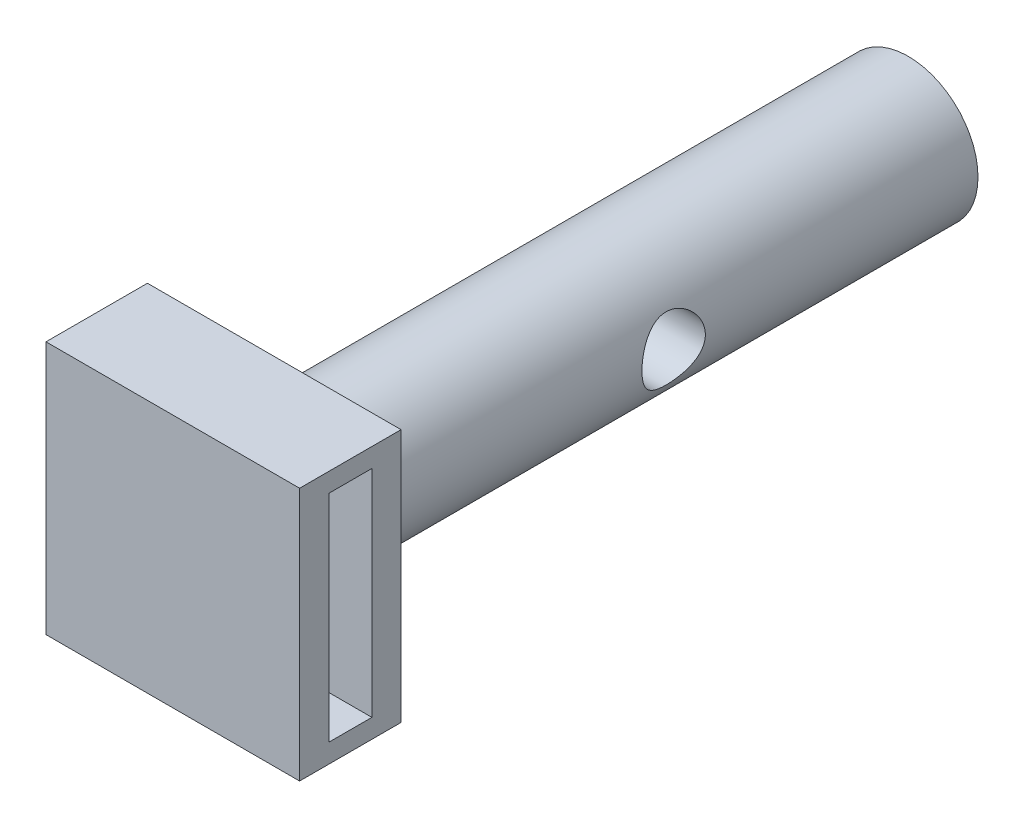
ISO-10303-21;
HEADER;
FILE_DESCRIPTION(('STEP AP214'),'2;1');
FILE_NAME('part.step','',(''),(''),'','','');
FILE_SCHEMA(('AUTOMOTIVE_DESIGN { 1 0 10303 214 1 1 1 1 }'));
ENDSEC;
DATA;
#1=APPLICATION_CONTEXT('core data for automotive mechanical design processes');
#2=APPLICATION_PROTOCOL_DEFINITION('international standard','automotive_design',2000,#1);
#3=PRODUCT_CONTEXT('',#1,'mechanical');
#4=PRODUCT('Part','Part','',(#3));
#5=PRODUCT_RELATED_PRODUCT_CATEGORY('part','',(#4));
#6=PRODUCT_DEFINITION_FORMATION('','',#4);
#7=PRODUCT_DEFINITION_CONTEXT('part definition',#1,'design');
#8=PRODUCT_DEFINITION('design','',#6,#7);
#9=PRODUCT_DEFINITION_SHAPE('','',#8);
#10=(LENGTH_UNIT() NAMED_UNIT(*) SI_UNIT(.MILLI.,.METRE.));
#11=(NAMED_UNIT(*) PLANE_ANGLE_UNIT() SI_UNIT($,.RADIAN.));
#12=(NAMED_UNIT(*) SI_UNIT($,.STERADIAN.) SOLID_ANGLE_UNIT());
#13=UNCERTAINTY_MEASURE_WITH_UNIT(LENGTH_MEASURE(1.E-05),#10,'distance_accuracy_value','');
#14=(GEOMETRIC_REPRESENTATION_CONTEXT(3) GLOBAL_UNCERTAINTY_ASSIGNED_CONTEXT((#13)) GLOBAL_UNIT_ASSIGNED_CONTEXT((#10,
#11,#12)) REPRESENTATION_CONTEXT('',''));
#15=CARTESIAN_POINT('',(0.,0.,0.));
#16=DIRECTION('',(0.,0.,1.));
#17=DIRECTION('',(1.,0.,0.));
#18=AXIS2_PLACEMENT_3D('',#15,#16,#17);
#19=CARTESIAN_POINT('',(0.,0.,0.));
#20=DIRECTION('',(0.,0.,1.));
#21=DIRECTION('',(1.,0.,0.));
#22=AXIS2_PLACEMENT_3D('',#19,#20,#21);
#23=PLANE('',#22);
#24=CARTESIAN_POINT('',(0.,0.,0.));
#25=DIRECTION('',(0.,0.,1.));
#26=DIRECTION('',(1.,0.,0.));
#27=AXIS2_PLACEMENT_3D('',#24,#25,#26);
#28=CIRCLE('',#27,2.75);
#29=CARTESIAN_POINT('',(2.75,0.,0.));
#30=VERTEX_POINT('',#29);
#31=EDGE_CURVE('E178',#30,#30,#28,.T.);
#32=ORIENTED_EDGE('',*,*,#31,.F.);
#33=EDGE_LOOP('',(#32));
#34=FACE_BOUND('',#33,.T.);
#35=ADVANCED_FACE('F39',(#34),#23,.F.);
#36=CARTESIAN_POINT('',(0.,0.,0.));
#37=DIRECTION('',(0.,0.,1.));
#38=DIRECTION('',(1.,0.,0.));
#39=AXIS2_PLACEMENT_3D('',#36,#37,#38);
#40=CYLINDRICAL_SURFACE('',#39,2.75);
#41=CARTESIAN_POINT('',(2.75,0.,10.75));
#42=CARTESIAN_POINT('',(2.74999722006381,0.066409297201123,10.7500033557613));
#43=CARTESIAN_POINT('',(2.74756773000003,0.132918179160474,10.7553234108164));
#44=CARTESIAN_POINT('',(2.73809041057661,0.264013618832331,10.7763886766761));
#45=CARTESIAN_POINT('',(2.73103186721671,0.328595352707353,10.792158073493));
#46=CARTESIAN_POINT('',(2.71304396647087,0.453733457531663,10.8334026879228));
#47=CARTESIAN_POINT('',(2.70212867062397,0.514303514696179,10.8588426722482));
#48=CARTESIAN_POINT('',(2.67746302459246,0.630245824955319,10.9185447192446));
#49=CARTESIAN_POINT('',(2.66371324300075,0.685619117274929,10.9528050129194));
#50=CARTESIAN_POINT('',(2.63383894536601,0.79287640462212,11.0312429596039));
#51=CARTESIAN_POINT('',(2.61762758087896,0.844423861031632,11.075847338062));
#52=CARTESIAN_POINT('',(2.58499080357135,0.939605833782934,11.1727994558039));
#53=CARTESIAN_POINT('',(2.56856526404589,0.983235414967036,11.2251519878079));
#54=CARTESIAN_POINT('',(2.53622246241453,1.0639942192231,11.3399724708472));
#55=CARTESIAN_POINT('',(2.5203974898297,1.10056379760175,11.4028629034675));
#56=CARTESIAN_POINT('',(2.49245983364399,1.16245662732703,11.5347160096519));
#57=CARTESIAN_POINT('',(2.4803448915189,1.1877867250721,11.6036749558868));
#58=CARTESIAN_POINT('',(2.46215702137186,1.22502813882895,11.7418477428022));
#59=CARTESIAN_POINT('',(2.45579257210869,1.23759151471749,11.8108457903637));
#60=CARTESIAN_POINT('',(2.44900910731335,1.25096639629459,11.9502409727118));
#61=CARTESIAN_POINT('',(2.4485858327753,1.25178632043297,12.0206370690328));
#62=CARTESIAN_POINT('',(2.45349076513661,1.24213570599715,12.1537053601308));
#63=CARTESIAN_POINT('',(2.45827909061313,1.23272508141617,12.2164786647792));
#64=CARTESIAN_POINT('',(2.47214054978987,1.20468382543911,12.3394330382549));
#65=CARTESIAN_POINT('',(2.48121470613038,1.18605099348516,12.3996134846596));
#66=CARTESIAN_POINT('',(2.502836041094,1.13972592389796,12.517318289944));
#67=CARTESIAN_POINT('',(2.51545758142744,1.11183710259722,12.5747509930054));
#68=CARTESIAN_POINT('',(2.5427424445358,1.0479342963697,12.6843707276341));
#69=CARTESIAN_POINT('',(2.55740664212108,1.01191682605958,12.7365554950875));
#70=CARTESIAN_POINT('',(2.58894610793606,0.928462390288523,12.839823282612));
#71=CARTESIAN_POINT('',(2.6058940299158,0.88023376649968,12.8902463667673));
#72=CARTESIAN_POINT('',(2.63884684198751,0.775874076245865,12.9825341366434));
#73=CARTESIAN_POINT('',(2.65485141943222,0.71974041051715,13.0243959961933));
#74=CARTESIAN_POINT('',(2.68475267309384,0.598831409627825,13.0996033419798));
#75=CARTESIAN_POINT('',(2.69856489262048,0.533836033425859,13.1326312395119));
#76=CARTESIAN_POINT('',(2.72184968026242,0.398422448040725,13.1870441979395));
#77=CARTESIAN_POINT('',(2.73132511002179,0.328007850689099,13.2084369380899));
#78=CARTESIAN_POINT('',(2.74430245200301,0.189224957177741,13.2374776846817));
#79=CARTESIAN_POINT('',(2.74818697383875,0.121077242101441,13.2460081996043));
#80=CARTESIAN_POINT('',(2.75080503667139,-0.0157830218141249,13.2517734422305));
#81=CARTESIAN_POINT('',(2.74954043674346,-0.0844953578581012,13.2490122467711));
#82=CARTESIAN_POINT('',(2.74224203969368,-0.216073389246549,13.2328570954785));
#83=CARTESIAN_POINT('',(2.73650576628531,-0.279039063698164,13.2201262392303));
#84=CARTESIAN_POINT('',(2.72118555280463,-0.401846731740725,13.1853663369372));
#85=CARTESIAN_POINT('',(2.71160115280357,-0.461688350977595,13.1633361794221));
#86=CARTESIAN_POINT('',(2.68910907975177,-0.578663737582032,13.109915125959));
#87=CARTESIAN_POINT('',(2.67610753251244,-0.635655904758835,13.0782550325619));
#88=CARTESIAN_POINT('',(2.64811200049283,-0.743723074643529,13.0067662226669));
#89=CARTESIAN_POINT('',(2.6331171430023,-0.794795467118613,12.9669339240432));
#90=CARTESIAN_POINT('',(2.60116069331972,-0.894095643067374,12.8763446734378));
#91=CARTESIAN_POINT('',(2.58413964097087,-0.941725318261072,12.8249515546263));
#92=CARTESIAN_POINT('',(2.55109013589481,-1.02789777986372,12.7147188168789));
#93=CARTESIAN_POINT('',(2.53506209027515,-1.06643685729908,12.6558761735236));
#94=CARTESIAN_POINT('',(2.5054683792703,-1.13425708875271,12.5302729155873));
#95=CARTESIAN_POINT('',(2.49198214330476,-1.16325589057755,12.4633396279147));
#96=CARTESIAN_POINT('',(2.46997777901049,-1.20928572229315,12.3247252932722));
#97=CARTESIAN_POINT('',(2.46145450187975,-1.22632915900213,12.2530492529609));
#98=CARTESIAN_POINT('',(2.45123100377802,-1.2466290380409,12.1137186902161));
#99=CARTESIAN_POINT('',(2.44899997173237,-1.25095942837577,12.04625953889));
#100=CARTESIAN_POINT('',(2.45016089632338,-1.24868510401172,11.9115834540738));
#101=CARTESIAN_POINT('',(2.45355149592204,-1.24208302836414,11.8443664660517));
#102=CARTESIAN_POINT('',(2.46505170930849,-1.21908425290037,11.7166868525956));
#103=CARTESIAN_POINT('',(2.47283643484033,-1.20335999852459,11.6560706930244));
#104=CARTESIAN_POINT('',(2.49193468099743,-1.16329328542381,11.5383535904614));
#105=CARTESIAN_POINT('',(2.50324923426469,-1.13894830444563,11.4812536820007));
#106=CARTESIAN_POINT('',(2.52904242136797,-1.08052106704645,11.3681064900194));
#107=CARTESIAN_POINT('',(2.54367923604935,-1.04590750399576,11.3123704781006));
#108=CARTESIAN_POINT('',(2.57411065746893,-0.968596555260979,11.2071656086921));
#109=CARTESIAN_POINT('',(2.58990577302476,-0.925895603760462,11.1576995318042));
#110=CARTESIAN_POINT('',(2.62263949427761,-0.828924012690177,11.0616700492789));
#111=CARTESIAN_POINT('',(2.6395474679947,-0.773945978687973,11.0158068811293));
#112=CARTESIAN_POINT('',(2.6711803863168,-0.656497888375396,10.9338686712023));
#113=CARTESIAN_POINT('',(2.68590431818336,-0.594024380555976,10.8977981638775));
#114=CARTESIAN_POINT('',(2.71142629318597,-0.463719738066244,10.8369915228084));
#115=CARTESIAN_POINT('',(2.72225776873055,-0.395940632153449,10.8121583674839));
#116=CARTESIAN_POINT('',(2.73888892791797,-0.256651849448492,10.7745196063775));
#117=CARTESIAN_POINT('',(2.7447037925775,-0.185154127024115,10.761677703486));
#118=CARTESIAN_POINT('',(2.74844792420964,-0.0943030237739496,10.7534182992831));
#119=CARTESIAN_POINT('',(2.74902888293267,-0.0754723356989377,10.7521377168886));
#120=CARTESIAN_POINT('',(2.74980531908613,-0.0377637835624764,10.7504280835196));
#121=CARTESIAN_POINT('',(2.75000079057679,-0.0188859187785945,10.7499990456662));
#122=CARTESIAN_POINT('',(2.75,0.,10.75));
#123=B_SPLINE_CURVE_WITH_KNOTS('',3,(#41,#42,#43,#44,#45,#46,#47,#48,#49,#50,#51,#52,#53,#54,
#55,#56,#57,#58,#59,#60,#61,#62,#63,#64,#65,#66,#67,#68,#69,#70,#71,#72,#73,#74,#75,#76,#77,#78,
#79,#80,#81,#82,#83,#84,#85,#86,#87,#88,#89,#90,#91,#92,#93,#94,#95,#96,#97,#98,#99,#100,#101,
#102,#103,#104,#105,#106,#107,#108,#109,#110,#111,#112,#113,#114,#115,#116,#117,#118,#119,#120,
#121,#122),.UNSPECIFIED.,.T.,.F.,(4,2,2,2,2,2,2,2,2,2,2,2,2,2,2,2,2,2,2,2,2,2,2,2,2,2,2,2,2,2,2,
2,2,2,2,2,2,2,2,2,4),(0.,0.199150465500601,0.39876350170033,0.597656142874561,0.796508925288679,
1.00581702909932,1.21525514848388,1.43748275689135,1.65957481148718,1.86964669042411,
2.07956796899307,2.26964626889943,2.45976994623912,2.65422185099479,2.8487572913309,
3.06321184122665,3.27773707147317,3.49916919969502,3.72045500384427,3.92572957947018,
4.1309300478908,4.32353422798305,4.51616143501641,4.71476455610418,4.91345491768044,
5.12881429156235,5.34426138090047,5.56560701120833,5.78672259633827,5.98852995638713,
6.19028860808862,6.37878337463006,6.56733333662171,6.76817468068633,6.96910478488007,
7.18876214345761,7.40852104069105,7.6263445727138,7.84350660241822,7.90014146715375,
7.95677720453813),.UNSPECIFIED.);
#124=CARTESIAN_POINT('',(2.75,0.,10.75));
#125=VERTEX_POINT('',#124);
#126=EDGE_CURVE('E43',#125,#125,#123,.T.);
#127=ORIENTED_EDGE('',*,*,#126,.F.);
#128=EDGE_LOOP('',(#127));
#129=FACE_BOUND('',#128,.T.);
#130=CARTESIAN_POINT('',(-2.75,0.,10.75));
#131=CARTESIAN_POINT('',(-2.74999722006381,-0.0664092972011245,10.7500033557613));
#132=CARTESIAN_POINT('',(-2.74756773000003,-0.132918179160476,10.7553234108164));
#133=CARTESIAN_POINT('',(-2.73809041057661,-0.264013618832332,10.7763886766761));
#134=CARTESIAN_POINT('',(-2.73103186721671,-0.328595352707355,10.792158073493));
#135=CARTESIAN_POINT('',(-2.71304396647087,-0.453733457531665,10.8334026879228));
#136=CARTESIAN_POINT('',(-2.70212867062397,-0.51430351469618,10.8588426722482));
#137=CARTESIAN_POINT('',(-2.67746302459246,-0.630245824955321,10.9185447192446));
#138=CARTESIAN_POINT('',(-2.66371324300075,-0.685619117274931,10.9528050129194));
#139=CARTESIAN_POINT('',(-2.63383894536601,-0.792876404622121,11.0312429596039));
#140=CARTESIAN_POINT('',(-2.61762758087896,-0.844423861031633,11.075847338062));
#141=CARTESIAN_POINT('',(-2.58499080357135,-0.939605833782935,11.1727994558039));
#142=CARTESIAN_POINT('',(-2.56856526404589,-0.983235414967038,11.2251519878079));
#143=CARTESIAN_POINT('',(-2.53622246241453,-1.0639942192231,11.3399724708472));
#144=CARTESIAN_POINT('',(-2.52039748982969,-1.10056379760175,11.4028629034675));
#145=CARTESIAN_POINT('',(-2.49245983364399,-1.16245662732703,11.5347160096519));
#146=CARTESIAN_POINT('',(-2.48034489151889,-1.1877867250721,11.6036749558868));
#147=CARTESIAN_POINT('',(-2.46215702137186,-1.22502813882896,11.7418477428022));
#148=CARTESIAN_POINT('',(-2.45579257210869,-1.23759151471749,11.8108457903637));
#149=CARTESIAN_POINT('',(-2.44900910731335,-1.25096639629459,11.9502409727118));
#150=CARTESIAN_POINT('',(-2.4485858327753,-1.25178632043297,12.0206370690328));
#151=CARTESIAN_POINT('',(-2.45349076513661,-1.24213570599715,12.1537053601308));
#152=CARTESIAN_POINT('',(-2.45827909061313,-1.23272508141617,12.2164786647792));
#153=CARTESIAN_POINT('',(-2.47214054978987,-1.20468382543912,12.3394330382549));
#154=CARTESIAN_POINT('',(-2.48121470613037,-1.18605099348517,12.3996134846596));
#155=CARTESIAN_POINT('',(-2.502836041094,-1.13972592389797,12.517318289944));
#156=CARTESIAN_POINT('',(-2.51545758142744,-1.11183710259723,12.5747509930054));
#157=CARTESIAN_POINT('',(-2.5427424445358,-1.0479342963697,12.6843707276341));
#158=CARTESIAN_POINT('',(-2.55740664212108,-1.01191682605958,12.7365554950875));
#159=CARTESIAN_POINT('',(-2.58894610793606,-0.928462390288527,12.839823282612));
#160=CARTESIAN_POINT('',(-2.6058940299158,-0.880233766499684,12.8902463667673));
#161=CARTESIAN_POINT('',(-2.63884684198751,-0.775874076245869,12.9825341366434));
#162=CARTESIAN_POINT('',(-2.65485141943222,-0.719740410517155,13.0243959961933));
#163=CARTESIAN_POINT('',(-2.68475267309383,-0.59883140962783,13.0996033419798));
#164=CARTESIAN_POINT('',(-2.69856489262048,-0.533836033425864,13.1326312395119));
#165=CARTESIAN_POINT('',(-2.72184968026242,-0.39842244804073,13.1870441979395));
#166=CARTESIAN_POINT('',(-2.73132511002178,-0.328007850689104,13.2084369380899));
#167=CARTESIAN_POINT('',(-2.74430245200301,-0.189224957177745,13.2374776846817));
#168=CARTESIAN_POINT('',(-2.74818697383875,-0.121077242101446,13.2460081996043));
#169=CARTESIAN_POINT('',(-2.75080503667139,0.0157830218141205,13.2517734422305));
#170=CARTESIAN_POINT('',(-2.74954043674346,0.0844953578580969,13.2490122467711));
#171=CARTESIAN_POINT('',(-2.74224203969369,0.216073389246544,13.2328570954786));
#172=CARTESIAN_POINT('',(-2.73650576628531,0.279039063698159,13.2201262392303));
#173=CARTESIAN_POINT('',(-2.72118555280463,0.40184673174072,13.1853663369372));
#174=CARTESIAN_POINT('',(-2.71160115280357,0.46168835097759,13.1633361794221));
#175=CARTESIAN_POINT('',(-2.68910907975177,0.578663737582027,13.109915125959));
#176=CARTESIAN_POINT('',(-2.67610753251244,0.63565590475883,13.0782550325619));
#177=CARTESIAN_POINT('',(-2.64811200049283,0.743723074643524,13.0067662226669));
#178=CARTESIAN_POINT('',(-2.6331171430023,0.794795467118608,12.9669339240432));
#179=CARTESIAN_POINT('',(-2.60116069331973,0.894095643067369,12.8763446734378));
#180=CARTESIAN_POINT('',(-2.58413964097088,0.941725318261068,12.8249515546263));
#181=CARTESIAN_POINT('',(-2.55109013589481,1.02789777986372,12.7147188168789));
#182=CARTESIAN_POINT('',(-2.53506209027515,1.06643685729908,12.6558761735236));
#183=CARTESIAN_POINT('',(-2.5054683792703,1.13425708875271,12.5302729155873));
#184=CARTESIAN_POINT('',(-2.49198214330476,1.16325589057754,12.4633396279147));
#185=CARTESIAN_POINT('',(-2.46997777901049,1.20928572229315,12.3247252932722));
#186=CARTESIAN_POINT('',(-2.46145450187975,1.22632915900213,12.2530492529609));
#187=CARTESIAN_POINT('',(-2.45123100377802,1.2466290380409,12.1137186902161));
#188=CARTESIAN_POINT('',(-2.44899997173237,1.25095942837577,12.04625953889));
#189=CARTESIAN_POINT('',(-2.45016089632338,1.24868510401172,11.9115834540738));
#190=CARTESIAN_POINT('',(-2.45355149592204,1.24208302836414,11.8443664660517));
#191=CARTESIAN_POINT('',(-2.4650517093085,1.21908425290037,11.7166868525956));
#192=CARTESIAN_POINT('',(-2.47283643484033,1.20335999852458,11.6560706930244));
#193=CARTESIAN_POINT('',(-2.49193468099743,1.16329328542381,11.5383535904614));
#194=CARTESIAN_POINT('',(-2.5032492342647,1.13894830444563,11.4812536820007));
#195=CARTESIAN_POINT('',(-2.52904242136797,1.08052106704645,11.3681064900194));
#196=CARTESIAN_POINT('',(-2.54367923604935,1.04590750399576,11.3123704781006));
#197=CARTESIAN_POINT('',(-2.57411065746893,0.968596555260977,11.2071656086921));
#198=CARTESIAN_POINT('',(-2.58990577302476,0.92589560376046,11.1576995318042));
#199=CARTESIAN_POINT('',(-2.62263949427761,0.828924012690174,11.0616700492789));
#200=CARTESIAN_POINT('',(-2.6395474679947,0.773945978687969,11.0158068811293));
#201=CARTESIAN_POINT('',(-2.6711803863168,0.656497888375393,10.9338686712023));
#202=CARTESIAN_POINT('',(-2.68590431818336,0.594024380555972,10.8977981638775));
#203=CARTESIAN_POINT('',(-2.71142629318597,0.463719738066242,10.8369915228084));
#204=CARTESIAN_POINT('',(-2.72225776873055,0.395940632153447,10.8121583674839));
#205=CARTESIAN_POINT('',(-2.73888892791797,0.25665184944849,10.7745196063775));
#206=CARTESIAN_POINT('',(-2.7447037925775,0.185154127024113,10.761677703486));
#207=CARTESIAN_POINT('',(-2.74844792420964,0.0943030237739481,10.7534182992831));
#208=CARTESIAN_POINT('',(-2.74902888293267,0.0754723356989362,10.7521377168886));
#209=CARTESIAN_POINT('',(-2.74980531908613,0.037763783562475,10.7504280835196));
#210=CARTESIAN_POINT('',(-2.75000079057679,0.018885918778593,10.7499990456662));
#211=CARTESIAN_POINT('',(-2.75,0.,10.75));
#212=B_SPLINE_CURVE_WITH_KNOTS('',3,(#130,#131,#132,#133,#134,#135,#136,#137,#138,#139,#140,
#141,#142,#143,#144,#145,#146,#147,#148,#149,#150,#151,#152,#153,#154,#155,#156,#157,#158,#159,
#160,#161,#162,#163,#164,#165,#166,#167,#168,#169,#170,#171,#172,#173,#174,#175,#176,#177,#178,
#179,#180,#181,#182,#183,#184,#185,#186,#187,#188,#189,#190,#191,#192,#193,#194,#195,#196,#197,
#198,#199,#200,#201,#202,#203,#204,#205,#206,#207,#208,#209,#210,#211),.UNSPECIFIED.,.T.,.F.,(4,
2,2,2,2,2,2,2,2,2,2,2,2,2,2,2,2,2,2,2,2,2,2,2,2,2,2,2,2,2,2,2,2,2,2,2,2,2,2,2,4),(0.,
0.199150465500601,0.39876350170033,0.59765614287456,0.796508925288679,1.00581702909932,
1.21525514848389,1.43748275689135,1.65957481148718,1.86964669042411,2.07956796899307,
2.26964626889943,2.45976994623912,2.65422185099479,2.8487572913309,3.06321184122665,
3.27773707147316,3.49916919969502,3.72045500384427,3.92572957947018,4.1309300478908,
4.32353422798305,4.51616143501641,4.71476455610418,4.91345491768045,5.12881429156235,
5.34426138090047,5.56560701120833,5.78672259633828,5.98852995638714,6.19028860808862,
6.37878337463006,6.56733333662171,6.76817468068633,6.96910478488007,7.18876214345762,
7.40852104069105,7.62634457271381,7.84350660241822,7.90014146715376,7.95677720453813),.UNSPECIFIED.);
#213=CARTESIAN_POINT('',(-2.75,0.,10.75));
#214=VERTEX_POINT('',#213);
#215=EDGE_CURVE('E131',#214,#214,#212,.T.);
#216=ORIENTED_EDGE('',*,*,#215,.F.);
#217=EDGE_LOOP('',(#216));
#218=FACE_BOUND('',#217,.T.);
#219=CARTESIAN_POINT('',(0.,0.,24.));
#220=DIRECTION('',(0.,0.,1.));
#221=DIRECTION('',(1.,0.,0.));
#222=AXIS2_PLACEMENT_3D('',#219,#220,#221);
#223=CIRCLE('',#222,2.75);
#224=CARTESIAN_POINT('',(2.75,0.,24.));
#225=VERTEX_POINT('',#224);
#226=EDGE_CURVE('E12',#225,#225,#223,.F.);
#227=ORIENTED_EDGE('',*,*,#226,.T.);
#228=EDGE_LOOP('',(#227));
#229=FACE_BOUND('',#228,.T.);
#230=ORIENTED_EDGE('',*,*,#31,.T.);
#231=EDGE_LOOP('',(#230));
#232=FACE_BOUND('',#231,.T.);
#233=ADVANCED_FACE('F187',(#129,#218,#229,#232),#40,.T.);
#234=CARTESIAN_POINT('',(0.,0.,25.));
#235=DIRECTION('',(0.,0.,1.));
#236=DIRECTION('',(1.,0.,0.));
#237=AXIS2_PLACEMENT_3D('',#234,#235,#236);
#238=PLANE('',#237);
#239=CARTESIAN_POINT('',(0.,0.,25.));
#240=DIRECTION('',(0.,0.,1.));
#241=DIRECTION('',(1.,0.,0.));
#242=AXIS2_PLACEMENT_3D('',#239,#240,#241);
#243=CIRCLE('',#242,3.75);
#244=CARTESIAN_POINT('',(3.75,0.,25.));
#245=VERTEX_POINT('',#244);
#246=EDGE_CURVE('E52',#245,#245,#243,.T.);
#247=ORIENTED_EDGE('',*,*,#246,.T.);
#248=EDGE_LOOP('',(#247));
#249=FACE_BOUND('',#248,.T.);
#250=DIRECTION('',(0.,-1.,0.));
#251=VECTOR('',#250,1.);
#252=CARTESIAN_POINT('',(5.,0.,25.));
#253=LINE('',#252,#251);
#254=CARTESIAN_POINT('',(5.,5.,25.));
#255=VERTEX_POINT('',#254);
#256=CARTESIAN_POINT('',(5.,-5.,25.));
#257=VERTEX_POINT('',#256);
#258=EDGE_CURVE('E148',#255,#257,#253,.T.);
#259=ORIENTED_EDGE('',*,*,#258,.T.);
#260=DIRECTION('',(1.,0.,0.));
#261=VECTOR('',#260,1.);
#262=CARTESIAN_POINT('',(0.,-5.,25.));
#263=LINE('',#262,#261);
#264=CARTESIAN_POINT('',(-5.,-5.,25.));
#265=VERTEX_POINT('',#264);
#266=EDGE_CURVE('E153',#265,#257,#263,.T.);
#267=ORIENTED_EDGE('',*,*,#266,.F.);
#268=DIRECTION('',(0.,-1.,0.));
#269=VECTOR('',#268,1.);
#270=CARTESIAN_POINT('',(-5.,0.,25.));
#271=LINE('',#270,#269);
#272=CARTESIAN_POINT('',(-5.,5.,25.));
#273=VERTEX_POINT('',#272);
#274=EDGE_CURVE('E166',#273,#265,#271,.T.);
#275=ORIENTED_EDGE('',*,*,#274,.F.);
#276=DIRECTION('',(1.,0.,0.));
#277=VECTOR('',#276,1.);
#278=CARTESIAN_POINT('',(0.,5.,25.));
#279=LINE('',#278,#277);
#280=EDGE_CURVE('E163',#273,#255,#279,.T.);
#281=ORIENTED_EDGE('',*,*,#280,.T.);
#282=EDGE_LOOP('',(#259,#267,#275,#281));
#283=FACE_BOUND('',#282,.T.);
#284=ADVANCED_FACE('F196',(#249,#283),#238,.F.);
#285=CARTESIAN_POINT('',(5.,0.,29.));
#286=DIRECTION('',(1.,0.,0.));
#287=DIRECTION('',(0.,0.,-1.));
#288=AXIS2_PLACEMENT_3D('',#285,#286,#287);
#289=PLANE('',#288);
#290=DIRECTION('',(0.,-1.,0.));
#291=VECTOR('',#290,1.);
#292=CARTESIAN_POINT('',(5.,0.,27.85));
#293=LINE('',#292,#291);
#294=CARTESIAN_POINT('',(5.,4.25,27.85));
#295=VERTEX_POINT('',#294);
#296=CARTESIAN_POINT('',(5.,-4.25,27.85));
#297=VERTEX_POINT('',#296);
#298=EDGE_CURVE('E116',#295,#297,#293,.T.);
#299=ORIENTED_EDGE('',*,*,#298,.F.);
#300=DIRECTION('',(0.,0.,1.));
#301=VECTOR('',#300,1.);
#302=CARTESIAN_POINT('',(5.,4.25,29.));
#303=LINE('',#302,#301);
#304=CARTESIAN_POINT('',(5.,4.25,26.15));
#305=VERTEX_POINT('',#304);
#306=EDGE_CURVE('E145',#305,#295,#303,.T.);
#307=ORIENTED_EDGE('',*,*,#306,.F.);
#308=DIRECTION('',(0.,1.,0.));
#309=VECTOR('',#308,1.);
#310=CARTESIAN_POINT('',(5.,0.,26.15));
#311=LINE('',#310,#309);
#312=CARTESIAN_POINT('',(5.,-4.25,26.15));
#313=VERTEX_POINT('',#312);
#314=EDGE_CURVE('E143',#313,#305,#311,.T.);
#315=ORIENTED_EDGE('',*,*,#314,.F.);
#316=DIRECTION('',(0.,0.,-1.));
#317=VECTOR('',#316,1.);
#318=CARTESIAN_POINT('',(5.,-4.25,29.));
#319=LINE('',#318,#317);
#320=EDGE_CURVE('E137',#297,#313,#319,.T.);
#321=ORIENTED_EDGE('',*,*,#320,.F.);
#322=EDGE_LOOP('',(#299,#307,#315,#321));
#323=FACE_BOUND('',#322,.T.);
#324=ORIENTED_EDGE('',*,*,#258,.F.);
#325=DIRECTION('',(0.,0.,-1.));
#326=VECTOR('',#325,1.);
#327=CARTESIAN_POINT('',(5.,5.,29.));
#328=LINE('',#327,#326);
#329=CARTESIAN_POINT('',(5.,5.,29.));
#330=VERTEX_POINT('',#329);
#331=EDGE_CURVE('E176',#330,#255,#328,.T.);
#332=ORIENTED_EDGE('',*,*,#331,.F.);
#333=DIRECTION('',(0.,-1.,0.));
#334=VECTOR('',#333,1.);
#335=CARTESIAN_POINT('',(5.,0.,29.));
#336=LINE('',#335,#334);
#337=CARTESIAN_POINT('',(5.,-5.,29.));
#338=VERTEX_POINT('',#337);
#339=EDGE_CURVE('E149',#330,#338,#336,.T.);
#340=ORIENTED_EDGE('',*,*,#339,.T.);
#341=DIRECTION('',(0.,0.,-1.));
#342=VECTOR('',#341,1.);
#343=CARTESIAN_POINT('',(5.,-5.,29.));
#344=LINE('',#343,#342);
#345=EDGE_CURVE('E160',#338,#257,#344,.T.);
#346=ORIENTED_EDGE('',*,*,#345,.T.);
#347=EDGE_LOOP('',(#324,#332,#340,#346));
#348=FACE_BOUND('',#347,.T.);
#349=ADVANCED_FACE('F231',(#323,#348),#289,.T.);
#350=CARTESIAN_POINT('',(0.,5.,29.));
#351=DIRECTION('',(0.,1.,0.));
#352=DIRECTION('',(0.,0.,1.));
#353=AXIS2_PLACEMENT_3D('',#350,#351,#352);
#354=PLANE('',#353);
#355=ORIENTED_EDGE('',*,*,#280,.F.);
#356=DIRECTION('',(0.,0.,-1.));
#357=VECTOR('',#356,1.);
#358=CARTESIAN_POINT('',(-5.,5.,29.));
#359=LINE('',#358,#357);
#360=CARTESIAN_POINT('',(-5.,5.,29.));
#361=VERTEX_POINT('',#360);
#362=EDGE_CURVE('E174',#361,#273,#359,.T.);
#363=ORIENTED_EDGE('',*,*,#362,.F.);
#364=DIRECTION('',(1.,0.,0.));
#365=VECTOR('',#364,1.);
#366=CARTESIAN_POINT('',(0.,5.,29.));
#367=LINE('',#366,#365);
#368=EDGE_CURVE('E152',#361,#330,#367,.T.);
#369=ORIENTED_EDGE('',*,*,#368,.T.);
#370=ORIENTED_EDGE('',*,*,#331,.T.);
#371=EDGE_LOOP('',(#355,#363,#369,#370));
#372=FACE_BOUND('',#371,.T.);
#373=ADVANCED_FACE('F238',(#372),#354,.T.);
#374=CARTESIAN_POINT('',(-5.,0.,29.));
#375=DIRECTION('',(1.,0.,0.));
#376=DIRECTION('',(0.,0.,-1.));
#377=AXIS2_PLACEMENT_3D('',#374,#375,#376);
#378=PLANE('',#377);
#379=DIRECTION('',(0.,0.,1.));
#380=VECTOR('',#379,1.);
#381=CARTESIAN_POINT('',(-5.,4.25,27.85));
#382=LINE('',#381,#380);
#383=CARTESIAN_POINT('',(-5.,4.25,26.15));
#384=VERTEX_POINT('',#383);
#385=CARTESIAN_POINT('',(-5.,4.25,27.85));
#386=VERTEX_POINT('',#385);
#387=EDGE_CURVE('E119',#384,#386,#382,.T.);
#388=ORIENTED_EDGE('',*,*,#387,.T.);
#389=DIRECTION('',(0.,-1.,0.));
#390=VECTOR('',#389,1.);
#391=CARTESIAN_POINT('',(-5.,4.25,27.85));
#392=LINE('',#391,#390);
#393=CARTESIAN_POINT('',(-5.,-4.25,27.85));
#394=VERTEX_POINT('',#393);
#395=EDGE_CURVE('E113',#386,#394,#392,.T.);
#396=ORIENTED_EDGE('',*,*,#395,.T.);
#397=DIRECTION('',(0.,0.,-1.));
#398=VECTOR('',#397,1.);
#399=CARTESIAN_POINT('',(-5.,-4.25,27.85));
#400=LINE('',#399,#398);
#401=CARTESIAN_POINT('',(-5.,-4.25,26.15));
#402=VERTEX_POINT('',#401);
#403=EDGE_CURVE('E122',#394,#402,#400,.T.);
#404=ORIENTED_EDGE('',*,*,#403,.T.);
#405=DIRECTION('',(0.,1.,0.));
#406=VECTOR('',#405,1.);
#407=CARTESIAN_POINT('',(-5.,4.25,26.15));
#408=LINE('',#407,#406);
#409=EDGE_CURVE('E68',#402,#384,#408,.T.);
#410=ORIENTED_EDGE('',*,*,#409,.T.);
#411=EDGE_LOOP('',(#388,#396,#404,#410));
#412=FACE_BOUND('',#411,.T.);
#413=ORIENTED_EDGE('',*,*,#274,.T.);
#414=DIRECTION('',(0.,0.,-1.));
#415=VECTOR('',#414,1.);
#416=CARTESIAN_POINT('',(-5.,-5.,29.));
#417=LINE('',#416,#415);
#418=CARTESIAN_POINT('',(-5.,-5.,29.));
#419=VERTEX_POINT('',#418);
#420=EDGE_CURVE('E171',#419,#265,#417,.T.);
#421=ORIENTED_EDGE('',*,*,#420,.F.);
#422=DIRECTION('',(0.,-1.,0.));
#423=VECTOR('',#422,1.);
#424=CARTESIAN_POINT('',(-5.,0.,29.));
#425=LINE('',#424,#423);
#426=EDGE_CURVE('E156',#361,#419,#425,.T.);
#427=ORIENTED_EDGE('',*,*,#426,.F.);
#428=ORIENTED_EDGE('',*,*,#362,.T.);
#429=EDGE_LOOP('',(#413,#421,#427,#428));
#430=FACE_BOUND('',#429,.T.);
#431=ADVANCED_FACE('F126',(#412,#430),#378,.F.);
#432=CARTESIAN_POINT('',(0.,-5.,29.));
#433=DIRECTION('',(0.,1.,0.));
#434=DIRECTION('',(0.,0.,1.));
#435=AXIS2_PLACEMENT_3D('',#432,#433,#434);
#436=PLANE('',#435);
#437=ORIENTED_EDGE('',*,*,#266,.T.);
#438=ORIENTED_EDGE('',*,*,#345,.F.);
#439=DIRECTION('',(1.,0.,0.));
#440=VECTOR('',#439,1.);
#441=CARTESIAN_POINT('',(0.,-5.,29.));
#442=LINE('',#441,#440);
#443=EDGE_CURVE('E158',#419,#338,#442,.T.);
#444=ORIENTED_EDGE('',*,*,#443,.F.);
#445=ORIENTED_EDGE('',*,*,#420,.T.);
#446=EDGE_LOOP('',(#437,#438,#444,#445));
#447=FACE_BOUND('',#446,.T.);
#448=ADVANCED_FACE('F227',(#447),#436,.F.);
#449=CARTESIAN_POINT('',(0.,0.,29.));
#450=DIRECTION('',(0.,0.,1.));
#451=DIRECTION('',(1.,0.,0.));
#452=AXIS2_PLACEMENT_3D('',#449,#450,#451);
#453=PLANE('',#452);
#454=ORIENTED_EDGE('',*,*,#339,.F.);
#455=ORIENTED_EDGE('',*,*,#368,.F.);
#456=ORIENTED_EDGE('',*,*,#426,.T.);
#457=ORIENTED_EDGE('',*,*,#443,.T.);
#458=EDGE_LOOP('',(#454,#455,#456,#457));
#459=FACE_BOUND('',#458,.T.);
#460=ADVANCED_FACE('F224',(#459),#453,.T.);
#461=CARTESIAN_POINT('',(-5.,4.25,27.85));
#462=DIRECTION('',(0.,0.,1.));
#463=DIRECTION('',(1.,0.,0.));
#464=AXIS2_PLACEMENT_3D('',#461,#462,#463);
#465=PLANE('',#464);
#466=ORIENTED_EDGE('',*,*,#298,.T.);
#467=DIRECTION('',(1.,0.,0.));
#468=VECTOR('',#467,1.);
#469=CARTESIAN_POINT('',(-5.,-4.25,27.85));
#470=LINE('',#469,#468);
#471=EDGE_CURVE('E60',#394,#297,#470,.T.);
#472=ORIENTED_EDGE('',*,*,#471,.F.);
#473=ORIENTED_EDGE('',*,*,#395,.F.);
#474=DIRECTION('',(1.,0.,0.));
#475=VECTOR('',#474,1.);
#476=CARTESIAN_POINT('',(-5.,4.25,27.85));
#477=LINE('',#476,#475);
#478=EDGE_CURVE('E135',#386,#295,#477,.T.);
#479=ORIENTED_EDGE('',*,*,#478,.T.);
#480=EDGE_LOOP('',(#466,#472,#473,#479));
#481=FACE_BOUND('',#480,.T.);
#482=ADVANCED_FACE('F110',(#481),#465,.F.);
#483=CARTESIAN_POINT('',(-5.,4.25,27.85));
#484=DIRECTION('',(0.,1.,0.));
#485=DIRECTION('',(0.,0.,1.));
#486=AXIS2_PLACEMENT_3D('',#483,#484,#485);
#487=PLANE('',#486);
#488=ORIENTED_EDGE('',*,*,#306,.T.);
#489=ORIENTED_EDGE('',*,*,#478,.F.);
#490=ORIENTED_EDGE('',*,*,#387,.F.);
#491=DIRECTION('',(1.,0.,0.));
#492=VECTOR('',#491,1.);
#493=CARTESIAN_POINT('',(-5.,4.25,26.15));
#494=LINE('',#493,#492);
#495=EDGE_CURVE('E138',#384,#305,#494,.T.);
#496=ORIENTED_EDGE('',*,*,#495,.T.);
#497=EDGE_LOOP('',(#488,#489,#490,#496));
#498=FACE_BOUND('',#497,.T.);
#499=ADVANCED_FACE('F212',(#498),#487,.F.);
#500=CARTESIAN_POINT('',(-5.,4.25,26.15));
#501=DIRECTION('',(0.,0.,-1.));
#502=DIRECTION('',(-1.,0.,0.));
#503=AXIS2_PLACEMENT_3D('',#500,#501,#502);
#504=PLANE('',#503);
#505=ORIENTED_EDGE('',*,*,#314,.T.);
#506=ORIENTED_EDGE('',*,*,#495,.F.);
#507=ORIENTED_EDGE('',*,*,#409,.F.);
#508=DIRECTION('',(1.,0.,0.));
#509=VECTOR('',#508,1.);
#510=CARTESIAN_POINT('',(-5.,-4.25,26.15));
#511=LINE('',#510,#509);
#512=EDGE_CURVE('E118',#402,#313,#511,.T.);
#513=ORIENTED_EDGE('',*,*,#512,.T.);
#514=EDGE_LOOP('',(#505,#506,#507,#513));
#515=FACE_BOUND('',#514,.T.);
#516=ADVANCED_FACE('F216',(#515),#504,.F.);
#517=CARTESIAN_POINT('',(-5.,-4.25,27.85));
#518=DIRECTION('',(0.,-1.,0.));
#519=DIRECTION('',(0.,0.,-1.));
#520=AXIS2_PLACEMENT_3D('',#517,#518,#519);
#521=PLANE('',#520);
#522=ORIENTED_EDGE('',*,*,#320,.T.);
#523=ORIENTED_EDGE('',*,*,#512,.F.);
#524=ORIENTED_EDGE('',*,*,#403,.F.);
#525=ORIENTED_EDGE('',*,*,#471,.T.);
#526=EDGE_LOOP('',(#522,#523,#524,#525));
#527=FACE_BOUND('',#526,.T.);
#528=ADVANCED_FACE('F123',(#527),#521,.F.);
#529=CARTESIAN_POINT('',(0.,0.,24.));
#530=DIRECTION('',(0.,0.,1.));
#531=DIRECTION('',(1.,0.,0.));
#532=AXIS2_PLACEMENT_3D('',#529,#530,#531);
#533=TOROIDAL_SURFACE('',#532,3.75,1.);
#534=ORIENTED_EDGE('',*,*,#226,.F.);
#535=EDGE_LOOP('',(#534));
#536=FACE_BOUND('',#535,.T.);
#537=ORIENTED_EDGE('',*,*,#246,.F.);
#538=EDGE_LOOP('',(#537));
#539=FACE_BOUND('',#538,.T.);
#540=ADVANCED_FACE('F41',(#536,#539),#533,.F.);
#541=CARTESIAN_POINT('',(-5.,0.,12.));
#542=DIRECTION('',(1.,0.,0.));
#543=DIRECTION('',(0.,0.,-1.));
#544=AXIS2_PLACEMENT_3D('',#541,#542,#543);
#545=CYLINDRICAL_SURFACE('',#544,1.25);
#546=ORIENTED_EDGE('',*,*,#126,.T.);
#547=EDGE_LOOP('',(#546));
#548=FACE_BOUND('',#547,.T.);
#549=ORIENTED_EDGE('',*,*,#215,.T.);
#550=EDGE_LOOP('',(#549));
#551=FACE_BOUND('',#550,.T.);
#552=ADVANCED_FACE('F207',(#548,#551),#545,.F.);
#553=CLOSED_SHELL('',(#35,#233,#284,#349,#373,#431,#448,#460,#482,#499,#516,#528,#540,#552));
#554=MANIFOLD_SOLID_BREP('B2',#553);
#555=ADVANCED_BREP_SHAPE_REPRESENTATION('',(#18,#554),#14);
#556=SHAPE_DEFINITION_REPRESENTATION(#9,#555);
ENDSEC;
END-ISO-10303-21;
